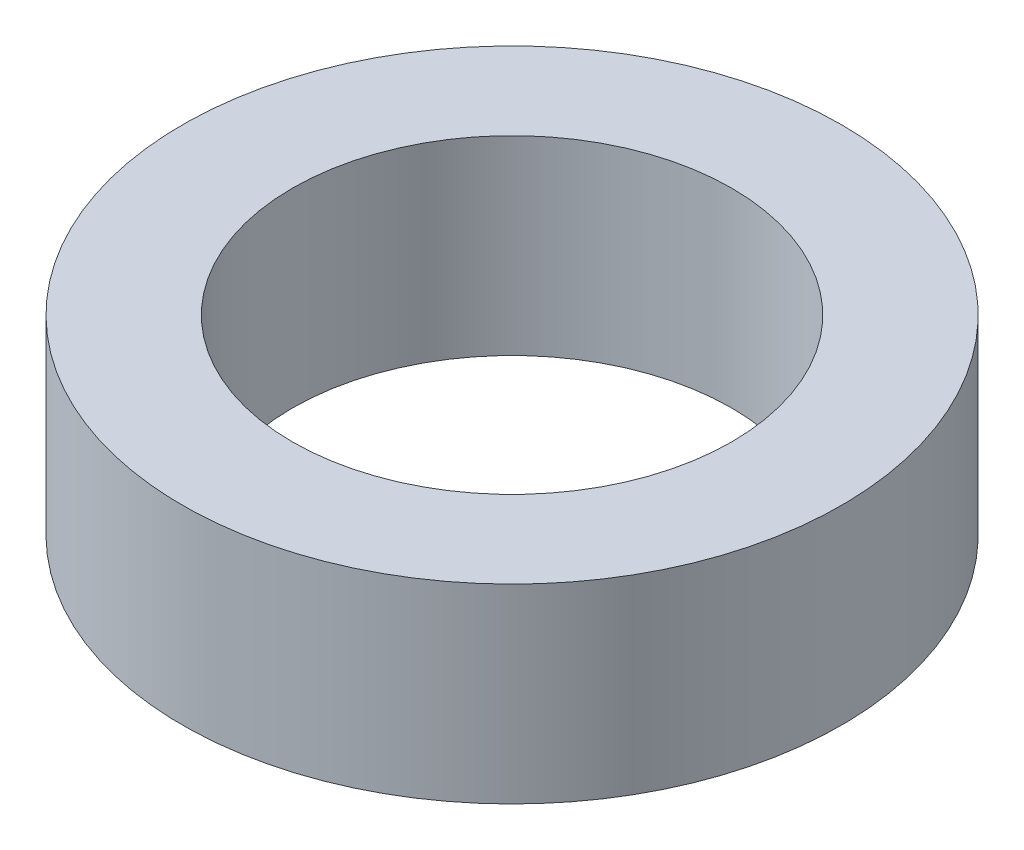
ISO-10303-21;
HEADER;
FILE_DESCRIPTION(('STEP AP214'),'2;1');
FILE_NAME('part.step','',(''),(''),'','','');
FILE_SCHEMA(('AUTOMOTIVE_DESIGN { 1 0 10303 214 1 1 1 1 }'));
ENDSEC;
DATA;
#1=APPLICATION_CONTEXT('core data for automotive mechanical design processes');
#2=APPLICATION_PROTOCOL_DEFINITION('international standard','automotive_design',2000,#1);
#3=PRODUCT_CONTEXT('',#1,'mechanical');
#4=PRODUCT('Part','Part','',(#3));
#5=PRODUCT_RELATED_PRODUCT_CATEGORY('part','',(#4));
#6=PRODUCT_DEFINITION_FORMATION('','',#4);
#7=PRODUCT_DEFINITION_CONTEXT('part definition',#1,'design');
#8=PRODUCT_DEFINITION('design','',#6,#7);
#9=PRODUCT_DEFINITION_SHAPE('','',#8);
#10=(LENGTH_UNIT() NAMED_UNIT(*) SI_UNIT(.MILLI.,.METRE.));
#11=(NAMED_UNIT(*) PLANE_ANGLE_UNIT() SI_UNIT($,.RADIAN.));
#12=(NAMED_UNIT(*) SI_UNIT($,.STERADIAN.) SOLID_ANGLE_UNIT());
#13=UNCERTAINTY_MEASURE_WITH_UNIT(LENGTH_MEASURE(1.E-05),#10,'distance_accuracy_value','');
#14=(GEOMETRIC_REPRESENTATION_CONTEXT(3) GLOBAL_UNCERTAINTY_ASSIGNED_CONTEXT((#13)) GLOBAL_UNIT_ASSIGNED_CONTEXT((#10,
#11,#12)) REPRESENTATION_CONTEXT('',''));
#15=CARTESIAN_POINT('',(0.,0.,0.));
#16=DIRECTION('',(0.,0.,1.));
#17=DIRECTION('',(1.,0.,0.));
#18=AXIS2_PLACEMENT_3D('',#15,#16,#17);
#19=CARTESIAN_POINT('',(0.,13.,0.));
#20=DIRECTION('',(0.,-1.,0.));
#21=DIRECTION('',(0.,0.,-1.));
#22=AXIS2_PLACEMENT_3D('',#19,#20,#21);
#23=CYLINDRICAL_SURFACE('',#22,22.5);
#24=CARTESIAN_POINT('',(0.,13.,0.));
#25=DIRECTION('',(0.,1.,0.));
#26=DIRECTION('',(0.,0.,1.));
#27=AXIS2_PLACEMENT_3D('',#24,#25,#26);
#28=CIRCLE('',#27,22.5);
#29=CARTESIAN_POINT('',(0.,13.,-22.5));
#30=VERTEX_POINT('',#29);
#31=EDGE_CURVE('E10',#30,#30,#28,.T.);
#32=CARTESIAN_POINT('',(0.,0.,0.));
#33=DIRECTION('',(0.,1.,0.));
#34=DIRECTION('',(0.,0.,1.));
#35=AXIS2_PLACEMENT_3D('',#32,#33,#34);
#36=CIRCLE('',#35,22.5);
#37=CARTESIAN_POINT('',(0.,0.,-22.5));
#38=VERTEX_POINT('',#37);
#39=EDGE_CURVE('E37',#38,#38,#36,.T.);
#40=CARTESIAN_POINT('',(0.,13.,-22.5));
#41=CARTESIAN_POINT('',(0.,12.8645833333333,-22.5));
#42=CARTESIAN_POINT('',(0.,12.7291666666667,-22.5));
#43=CARTESIAN_POINT('',(0.,12.4583333333333,-22.5));
#44=CARTESIAN_POINT('',(0.,12.3229166666667,-22.5));
#45=CARTESIAN_POINT('',(0.,12.0520833333333,-22.5));
#46=CARTESIAN_POINT('',(0.,11.9166666666667,-22.5));
#47=CARTESIAN_POINT('',(0.,11.6458333333333,-22.5));
#48=CARTESIAN_POINT('',(0.,11.5104166666667,-22.5));
#49=CARTESIAN_POINT('',(0.,11.2395833333333,-22.5));
#50=CARTESIAN_POINT('',(0.,11.1041666666667,-22.5));
#51=CARTESIAN_POINT('',(0.,10.8333333333333,-22.5));
#52=CARTESIAN_POINT('',(0.,10.6979166666667,-22.5));
#53=CARTESIAN_POINT('',(0.,10.4270833333333,-22.5));
#54=CARTESIAN_POINT('',(0.,10.2916666666667,-22.5));
#55=CARTESIAN_POINT('',(0.,10.0208333333333,-22.5));
#56=CARTESIAN_POINT('',(0.,9.88541666666667,-22.5));
#57=CARTESIAN_POINT('',(0.,9.61458333333333,-22.5));
#58=CARTESIAN_POINT('',(0.,9.47916666666667,-22.5));
#59=CARTESIAN_POINT('',(0.,9.20833333333333,-22.5));
#60=CARTESIAN_POINT('',(0.,9.07291666666667,-22.5));
#61=CARTESIAN_POINT('',(0.,8.80208333333333,-22.5));
#62=CARTESIAN_POINT('',(0.,8.66666666666667,-22.5));
#63=CARTESIAN_POINT('',(0.,8.39583333333333,-22.5));
#64=CARTESIAN_POINT('',(0.,8.26041666666667,-22.5));
#65=CARTESIAN_POINT('',(0.,7.98958333333333,-22.5));
#66=CARTESIAN_POINT('',(0.,7.85416666666667,-22.5));
#67=CARTESIAN_POINT('',(0.,7.58333333333333,-22.5));
#68=CARTESIAN_POINT('',(0.,7.44791666666667,-22.5));
#69=CARTESIAN_POINT('',(0.,7.17708333333333,-22.5));
#70=CARTESIAN_POINT('',(0.,7.04166666666667,-22.5));
#71=CARTESIAN_POINT('',(0.,6.77083333333333,-22.5));
#72=CARTESIAN_POINT('',(0.,6.63541666666667,-22.5));
#73=CARTESIAN_POINT('',(0.,6.36458333333333,-22.5));
#74=CARTESIAN_POINT('',(0.,6.22916666666667,-22.5));
#75=CARTESIAN_POINT('',(0.,5.95833333333333,-22.5));
#76=CARTESIAN_POINT('',(0.,5.82291666666667,-22.5));
#77=CARTESIAN_POINT('',(0.,5.55208333333333,-22.5));
#78=CARTESIAN_POINT('',(0.,5.41666666666667,-22.5));
#79=CARTESIAN_POINT('',(0.,5.14583333333333,-22.5));
#80=CARTESIAN_POINT('',(0.,5.01041666666667,-22.5));
#81=CARTESIAN_POINT('',(0.,4.73958333333333,-22.5));
#82=CARTESIAN_POINT('',(0.,4.60416666666667,-22.5));
#83=CARTESIAN_POINT('',(0.,4.33333333333333,-22.5));
#84=CARTESIAN_POINT('',(0.,4.19791666666667,-22.5));
#85=CARTESIAN_POINT('',(0.,3.92708333333333,-22.5));
#86=CARTESIAN_POINT('',(0.,3.79166666666667,-22.5));
#87=CARTESIAN_POINT('',(0.,3.52083333333333,-22.5));
#88=CARTESIAN_POINT('',(0.,3.38541666666667,-22.5));
#89=CARTESIAN_POINT('',(0.,3.11458333333333,-22.5));
#90=CARTESIAN_POINT('',(0.,2.97916666666667,-22.5));
#91=CARTESIAN_POINT('',(0.,2.70833333333333,-22.5));
#92=CARTESIAN_POINT('',(0.,2.57291666666667,-22.5));
#93=CARTESIAN_POINT('',(0.,2.30208333333333,-22.5));
#94=CARTESIAN_POINT('',(0.,2.16666666666667,-22.5));
#95=CARTESIAN_POINT('',(0.,1.89583333333333,-22.5));
#96=CARTESIAN_POINT('',(0.,1.76041666666667,-22.5));
#97=CARTESIAN_POINT('',(0.,1.48958333333333,-22.5));
#98=CARTESIAN_POINT('',(0.,1.35416666666667,-22.5));
#99=CARTESIAN_POINT('',(0.,1.08333333333333,-22.5));
#100=CARTESIAN_POINT('',(0.,0.947916666666667,-22.5));
#101=CARTESIAN_POINT('',(0.,0.677083333333334,-22.5));
#102=CARTESIAN_POINT('',(0.,0.541666666666667,-22.5));
#103=CARTESIAN_POINT('',(0.,0.270833333333334,-22.5));
#104=CARTESIAN_POINT('',(0.,0.135416666666667,-22.5));
#105=CARTESIAN_POINT('',(0.,0.,-22.5));
#106=B_SPLINE_CURVE_WITH_KNOTS('',3,(#40,#41,#42,#43,#44,#45,#46,#47,#48,#49,#50,#51,#52,#53,
#54,#55,#56,#57,#58,#59,#60,#61,#62,#63,#64,#65,#66,#67,#68,#69,#70,#71,#72,#73,#74,#75,#76,#77,
#78,#79,#80,#81,#82,#83,#84,#85,#86,#87,#88,#89,#90,#91,#92,#93,#94,#95,#96,#97,#98,#99,#100,
#101,#102,#103,#104,#105),.UNSPECIFIED.,.F.,.F.,(4,2,2,2,2,2,2,2,2,2,2,2,2,2,2,2,2,2,2,2,2,2,2,
2,2,2,2,2,2,2,2,2,4),(0.,0.406249999999999,0.812499999999999,1.21875,1.625,2.03125,2.4375,
2.84375,3.25,3.65625,4.0625,4.46875,4.875,5.28125,5.6875,6.09375,6.5,6.90625,7.3125,7.71875,
8.125,8.53125,8.9375,9.34375,9.75,10.15625,10.5625,10.96875,11.375,11.78125,12.1875,12.59375,
13.),.UNSPECIFIED.);
#107=EDGE_CURVE('BSEAM40',#30,#38,#106,.T.);
#108=ORIENTED_EDGE('',*,*,#31,.F.);
#109=ORIENTED_EDGE('',*,*,#39,.T.);
#110=ORIENTED_EDGE('',*,*,#107,.T.);
#111=ORIENTED_EDGE('',*,*,#107,.F.);
#112=EDGE_LOOP('',(#108,#110,#109,#111));
#113=FACE_BOUND('',#112,.T.);
#114=ADVANCED_FACE('F40',(#113),#23,.T.);
#115=CARTESIAN_POINT('',(0.,13.,0.));
#116=DIRECTION('',(0.,1.,0.));
#117=DIRECTION('',(0.,0.,1.));
#118=AXIS2_PLACEMENT_3D('',#115,#116,#117);
#119=PLANE('',#118);
#120=CARTESIAN_POINT('',(0.,13.,0.));
#121=DIRECTION('',(0.,1.,0.));
#122=DIRECTION('',(0.,0.,1.));
#123=AXIS2_PLACEMENT_3D('',#120,#121,#122);
#124=CIRCLE('',#123,15.);
#125=CARTESIAN_POINT('',(0.,13.,-15.));
#126=VERTEX_POINT('',#125);
#127=EDGE_CURVE('E50',#126,#126,#124,.T.);
#128=ORIENTED_EDGE('',*,*,#127,.F.);
#129=EDGE_LOOP('',(#128));
#130=FACE_BOUND('',#129,.T.);
#131=ORIENTED_EDGE('',*,*,#31,.T.);
#132=EDGE_LOOP('',(#131));
#133=FACE_BOUND('',#132,.T.);
#134=ADVANCED_FACE('F59',(#130,#133),#119,.T.);
#135=CARTESIAN_POINT('',(0.,0.,0.));
#136=DIRECTION('',(0.,1.,0.));
#137=DIRECTION('',(0.,0.,1.));
#138=AXIS2_PLACEMENT_3D('',#135,#136,#137);
#139=PLANE('',#138);
#140=CARTESIAN_POINT('',(0.,0.,0.));
#141=DIRECTION('',(0.,1.,0.));
#142=DIRECTION('',(0.,0.,1.));
#143=AXIS2_PLACEMENT_3D('',#140,#141,#142);
#144=CIRCLE('',#143,15.);
#145=CARTESIAN_POINT('',(0.,0.,-15.));
#146=VERTEX_POINT('',#145);
#147=EDGE_CURVE('E47',#146,#146,#144,.T.);
#148=ORIENTED_EDGE('',*,*,#147,.T.);
#149=EDGE_LOOP('',(#148));
#150=FACE_BOUND('',#149,.T.);
#151=ORIENTED_EDGE('',*,*,#39,.F.);
#152=EDGE_LOOP('',(#151));
#153=FACE_BOUND('',#152,.T.);
#154=ADVANCED_FACE('F58',(#150,#153),#139,.F.);
#155=CARTESIAN_POINT('',(0.,13.,0.));
#156=DIRECTION('',(0.,-1.,0.));
#157=DIRECTION('',(0.,0.,-1.));
#158=AXIS2_PLACEMENT_3D('',#155,#156,#157);
#159=CYLINDRICAL_SURFACE('',#158,15.);
#160=CARTESIAN_POINT('',(0.,13.,-15.));
#161=CARTESIAN_POINT('',(0.,12.8645833333333,-15.));
#162=CARTESIAN_POINT('',(0.,12.7291666666667,-15.));
#163=CARTESIAN_POINT('',(0.,12.4583333333333,-15.));
#164=CARTESIAN_POINT('',(0.,12.3229166666667,-15.));
#165=CARTESIAN_POINT('',(0.,12.0520833333333,-15.));
#166=CARTESIAN_POINT('',(0.,11.9166666666667,-15.));
#167=CARTESIAN_POINT('',(0.,11.6458333333333,-15.));
#168=CARTESIAN_POINT('',(0.,11.5104166666667,-15.));
#169=CARTESIAN_POINT('',(0.,11.2395833333333,-15.));
#170=CARTESIAN_POINT('',(0.,11.1041666666667,-15.));
#171=CARTESIAN_POINT('',(0.,10.8333333333333,-15.));
#172=CARTESIAN_POINT('',(0.,10.6979166666667,-15.));
#173=CARTESIAN_POINT('',(0.,10.4270833333333,-15.));
#174=CARTESIAN_POINT('',(0.,10.2916666666667,-15.));
#175=CARTESIAN_POINT('',(0.,10.0208333333333,-15.));
#176=CARTESIAN_POINT('',(0.,9.88541666666667,-15.));
#177=CARTESIAN_POINT('',(0.,9.61458333333333,-15.));
#178=CARTESIAN_POINT('',(0.,9.47916666666667,-15.));
#179=CARTESIAN_POINT('',(0.,9.20833333333333,-15.));
#180=CARTESIAN_POINT('',(0.,9.07291666666666,-15.));
#181=CARTESIAN_POINT('',(0.,8.80208333333333,-15.));
#182=CARTESIAN_POINT('',(0.,8.66666666666667,-15.));
#183=CARTESIAN_POINT('',(0.,8.39583333333333,-15.));
#184=CARTESIAN_POINT('',(0.,8.26041666666667,-15.));
#185=CARTESIAN_POINT('',(0.,7.98958333333333,-15.));
#186=CARTESIAN_POINT('',(0.,7.85416666666667,-15.));
#187=CARTESIAN_POINT('',(0.,7.58333333333333,-15.));
#188=CARTESIAN_POINT('',(0.,7.44791666666667,-15.));
#189=CARTESIAN_POINT('',(0.,7.17708333333333,-15.));
#190=CARTESIAN_POINT('',(0.,7.04166666666667,-15.));
#191=CARTESIAN_POINT('',(0.,6.77083333333333,-15.));
#192=CARTESIAN_POINT('',(0.,6.63541666666667,-15.));
#193=CARTESIAN_POINT('',(0.,6.36458333333333,-15.));
#194=CARTESIAN_POINT('',(0.,6.22916666666667,-15.));
#195=CARTESIAN_POINT('',(0.,5.95833333333333,-15.));
#196=CARTESIAN_POINT('',(0.,5.82291666666667,-15.));
#197=CARTESIAN_POINT('',(0.,5.55208333333333,-15.));
#198=CARTESIAN_POINT('',(0.,5.41666666666667,-15.));
#199=CARTESIAN_POINT('',(0.,5.14583333333333,-15.));
#200=CARTESIAN_POINT('',(0.,5.01041666666667,-15.));
#201=CARTESIAN_POINT('',(0.,4.73958333333333,-15.));
#202=CARTESIAN_POINT('',(0.,4.60416666666667,-15.));
#203=CARTESIAN_POINT('',(0.,4.33333333333333,-15.));
#204=CARTESIAN_POINT('',(0.,4.19791666666667,-15.));
#205=CARTESIAN_POINT('',(0.,3.92708333333333,-15.));
#206=CARTESIAN_POINT('',(0.,3.79166666666667,-15.));
#207=CARTESIAN_POINT('',(0.,3.52083333333333,-15.));
#208=CARTESIAN_POINT('',(0.,3.38541666666667,-15.));
#209=CARTESIAN_POINT('',(0.,3.11458333333333,-15.));
#210=CARTESIAN_POINT('',(0.,2.97916666666667,-15.));
#211=CARTESIAN_POINT('',(0.,2.70833333333333,-15.));
#212=CARTESIAN_POINT('',(0.,2.57291666666667,-15.));
#213=CARTESIAN_POINT('',(0.,2.30208333333333,-15.));
#214=CARTESIAN_POINT('',(0.,2.16666666666667,-15.));
#215=CARTESIAN_POINT('',(0.,1.89583333333333,-15.));
#216=CARTESIAN_POINT('',(0.,1.76041666666667,-15.));
#217=CARTESIAN_POINT('',(0.,1.48958333333333,-15.));
#218=CARTESIAN_POINT('',(0.,1.35416666666667,-15.));
#219=CARTESIAN_POINT('',(0.,1.08333333333333,-15.));
#220=CARTESIAN_POINT('',(0.,0.947916666666667,-15.));
#221=CARTESIAN_POINT('',(0.,0.677083333333334,-15.));
#222=CARTESIAN_POINT('',(0.,0.541666666666667,-15.));
#223=CARTESIAN_POINT('',(0.,0.270833333333334,-15.));
#224=CARTESIAN_POINT('',(0.,0.135416666666667,-15.));
#225=CARTESIAN_POINT('',(0.,0.,-15.));
#226=B_SPLINE_CURVE_WITH_KNOTS('',3,(#160,#161,#162,#163,#164,#165,#166,#167,#168,#169,#170,
#171,#172,#173,#174,#175,#176,#177,#178,#179,#180,#181,#182,#183,#184,#185,#186,#187,#188,#189,
#190,#191,#192,#193,#194,#195,#196,#197,#198,#199,#200,#201,#202,#203,#204,#205,#206,#207,#208,
#209,#210,#211,#212,#213,#214,#215,#216,#217,#218,#219,#220,#221,#222,#223,#224,#225),
.UNSPECIFIED.,.F.,.F.,(4,2,2,2,2,2,2,2,2,2,2,2,2,2,2,2,2,2,2,2,2,2,2,2,2,2,2,2,2,2,2,2,4),(0.,
0.40625,0.812500000000001,1.21875,1.625,2.03125,2.4375,2.84375,3.25,3.65625,4.0625,4.46875,
4.875,5.28125,5.6875,6.09375,6.5,6.90625,7.3125,7.71875,8.125,8.53125,8.9375,9.34375,9.75,
10.15625,10.5625,10.96875,11.375,11.78125,12.1875,12.59375,13.),.UNSPECIFIED.);
#227=EDGE_CURVE('BSEAM54',#126,#146,#226,.T.);
#228=ORIENTED_EDGE('',*,*,#127,.T.);
#229=ORIENTED_EDGE('',*,*,#147,.F.);
#230=ORIENTED_EDGE('',*,*,#227,.T.);
#231=ORIENTED_EDGE('',*,*,#227,.F.);
#232=EDGE_LOOP('',(#228,#230,#229,#231));
#233=FACE_BOUND('',#232,.T.);
#234=ADVANCED_FACE('F54',(#233),#159,.F.);
#235=CLOSED_SHELL('',(#114,#134,#154,#234));
#236=MANIFOLD_SOLID_BREP('B2',#235);
#237=ADVANCED_BREP_SHAPE_REPRESENTATION('',(#18,#236),#14);
#238=SHAPE_DEFINITION_REPRESENTATION(#9,#237);
ENDSEC;
END-ISO-10303-21;
